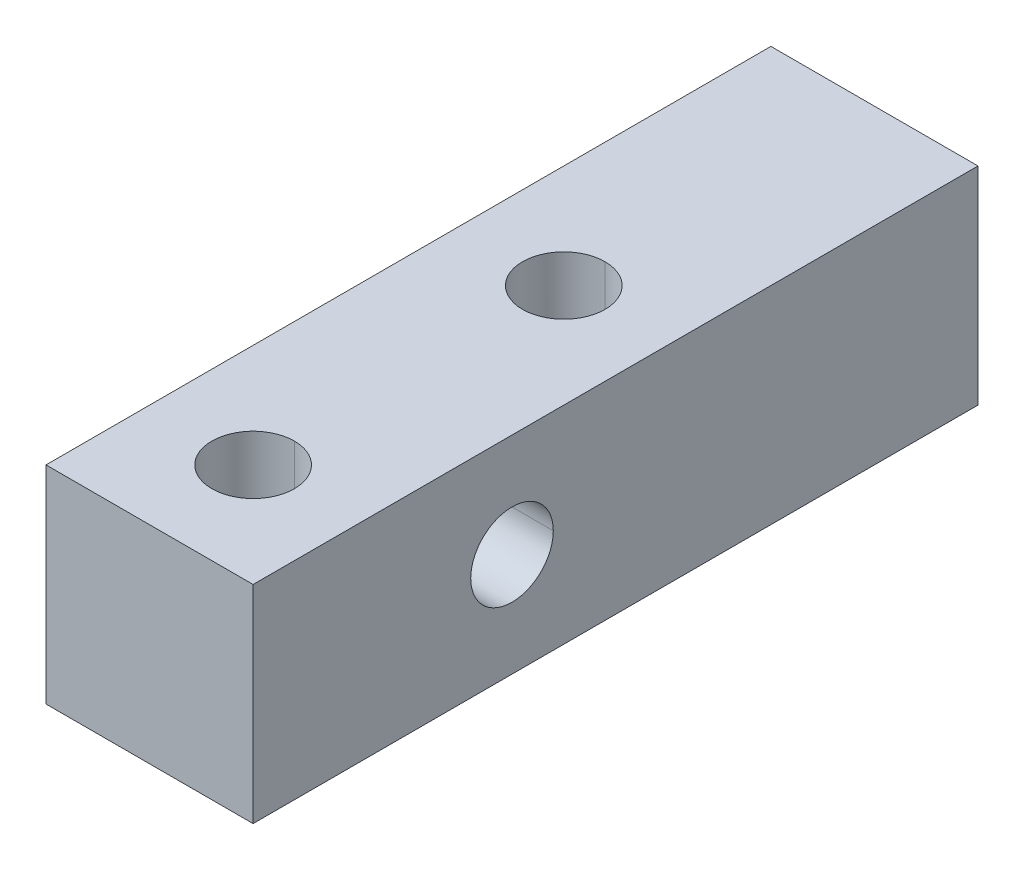
ISO-10303-21;
HEADER;
FILE_DESCRIPTION(('STEP AP214'),'2;1');
FILE_NAME('part.step','',(''),(''),'','','');
FILE_SCHEMA(('AUTOMOTIVE_DESIGN { 1 0 10303 214 1 1 1 1 }'));
ENDSEC;
DATA;
#1=APPLICATION_CONTEXT('core data for automotive mechanical design processes');
#2=APPLICATION_PROTOCOL_DEFINITION('international standard','automotive_design',2000,#1);
#3=PRODUCT_CONTEXT('',#1,'mechanical');
#4=PRODUCT('Part','Part','',(#3));
#5=PRODUCT_RELATED_PRODUCT_CATEGORY('part','',(#4));
#6=PRODUCT_DEFINITION_FORMATION('','',#4);
#7=PRODUCT_DEFINITION_CONTEXT('part definition',#1,'design');
#8=PRODUCT_DEFINITION('design','',#6,#7);
#9=PRODUCT_DEFINITION_SHAPE('','',#8);
#10=(LENGTH_UNIT() NAMED_UNIT(*) SI_UNIT(.MILLI.,.METRE.));
#11=(NAMED_UNIT(*) PLANE_ANGLE_UNIT() SI_UNIT($,.RADIAN.));
#12=(NAMED_UNIT(*) SI_UNIT($,.STERADIAN.) SOLID_ANGLE_UNIT());
#13=UNCERTAINTY_MEASURE_WITH_UNIT(LENGTH_MEASURE(1.E-05),#10,'distance_accuracy_value','');
#14=(GEOMETRIC_REPRESENTATION_CONTEXT(3) GLOBAL_UNCERTAINTY_ASSIGNED_CONTEXT((#13)) GLOBAL_UNIT_ASSIGNED_CONTEXT((#10,
#11,#12)) REPRESENTATION_CONTEXT('',''));
#15=CARTESIAN_POINT('',(0.,0.,0.));
#16=DIRECTION('',(0.,0.,1.));
#17=DIRECTION('',(1.,0.,0.));
#18=AXIS2_PLACEMENT_3D('',#15,#16,#17);
#19=CARTESIAN_POINT('',(0.,4.7625,-19.05));
#20=DIRECTION('',(0.,1.,0.));
#21=DIRECTION('',(0.,0.,1.));
#22=AXIS2_PLACEMENT_3D('',#19,#20,#21);
#23=CYLINDRICAL_SURFACE('',#22,1.89865);
#24=DIRECTION('',(0.,1.,0.));
#25=VECTOR('',#24,1.);
#26=CARTESIAN_POINT('',(0.,4.7625,-20.94865));
#27=LINE('',#26,#25);
#28=CARTESIAN_POINT('',(0.,-4.7625,-20.94865));
#29=VERTEX_POINT('',#28);
#30=CARTESIAN_POINT('',(0.,-1.89865,-20.94865));
#31=VERTEX_POINT('',#30);
#32=EDGE_CURVE('E227',#29,#31,#27,.T.);
#33=ORIENTED_EDGE('',*,*,#32,.F.);
#34=CARTESIAN_POINT('',(0.,-4.7625,-19.05));
#35=DIRECTION('',(0.,1.,0.));
#36=DIRECTION('',(0.,0.,1.));
#37=AXIS2_PLACEMENT_3D('',#34,#35,#36);
#38=CIRCLE('',#37,1.89865);
#39=CARTESIAN_POINT('',(0.,-4.7625,-17.15135));
#40=VERTEX_POINT('',#39);
#41=EDGE_CURVE('E200',#40,#29,#38,.T.);
#42=ORIENTED_EDGE('',*,*,#41,.F.);
#43=DIRECTION('',(0.,1.,0.));
#44=VECTOR('',#43,1.);
#45=CARTESIAN_POINT('',(0.,4.7625,-17.15135));
#46=LINE('',#45,#44);
#47=CARTESIAN_POINT('',(0.,4.7625,-17.15135));
#48=VERTEX_POINT('',#47);
#49=EDGE_CURVE('E216',#40,#48,#46,.T.);
#50=ORIENTED_EDGE('',*,*,#49,.T.);
#51=CARTESIAN_POINT('',(0.,4.7625,-19.05));
#52=DIRECTION('',(0.,1.,0.));
#53=DIRECTION('',(0.,0.,1.));
#54=AXIS2_PLACEMENT_3D('',#51,#52,#53);
#55=CIRCLE('',#54,1.89865);
#56=CARTESIAN_POINT('',(0.,4.7625,-20.94865));
#57=VERTEX_POINT('',#56);
#58=EDGE_CURVE('E171',#48,#57,#55,.T.);
#59=ORIENTED_EDGE('',*,*,#58,.T.);
#60=DIRECTION('',(0.,1.,0.));
#61=VECTOR('',#60,1.);
#62=CARTESIAN_POINT('',(0.,4.7625,-20.94865));
#63=LINE('',#62,#61);
#64=CARTESIAN_POINT('',(0.,1.89865,-20.94865));
#65=VERTEX_POINT('',#64);
#66=EDGE_CURVE('E203',#65,#57,#63,.T.);
#67=ORIENTED_EDGE('',*,*,#66,.F.);
#68=CARTESIAN_POINT('',(1.89865,0.,-19.05));
#69=CARTESIAN_POINT('',(1.89864999999999,1.11220341980032,-20.1622034198003));
#70=CARTESIAN_POINT('',(1.11220341980032,1.89864999999999,-20.94865));
#71=CARTESIAN_POINT('',(0.,1.89865,-20.94865));
#72=(BOUNDED_CURVE() B_SPLINE_CURVE(3,(#68,#69,#70,#71),.UNSPECIFIED.,.F.,
.F.) B_SPLINE_CURVE_WITH_KNOTS((4,4),(4.71238898038469,6.28318530717959),
.UNSPECIFIED.) CURVE() GEOMETRIC_REPRESENTATION_ITEM() RATIONAL_B_SPLINE_CURVE((1.,
0.804737854124365,0.804737854124365,1.)) REPRESENTATION_ITEM(''));
#73=CARTESIAN_POINT('',(1.89865,0.,-19.05));
#74=VERTEX_POINT('',#73);
#75=EDGE_CURVE('E11',#74,#65,#72,.T.);
#76=ORIENTED_EDGE('',*,*,#75,.F.);
#77=CARTESIAN_POINT('',(0.,-1.89865,-20.94865));
#78=CARTESIAN_POINT('',(1.11220341980032,-1.89864999999999,-20.94865));
#79=CARTESIAN_POINT('',(1.89864999999999,-1.11220341980032,-20.1622034198003));
#80=CARTESIAN_POINT('',(1.89865,0.,-19.05));
#81=(BOUNDED_CURVE() B_SPLINE_CURVE(3,(#77,#78,#79,#80),.UNSPECIFIED.,.F.,
.F.) B_SPLINE_CURVE_WITH_KNOTS((4,4),(0.,1.5707963267949),
.UNSPECIFIED.) CURVE() GEOMETRIC_REPRESENTATION_ITEM() RATIONAL_B_SPLINE_CURVE((1.,
0.804737854124365,0.804737854124365,1.)) REPRESENTATION_ITEM(''));
#82=EDGE_CURVE('E247',#31,#74,#81,.T.);
#83=ORIENTED_EDGE('',*,*,#82,.F.);
#84=EDGE_LOOP('',(#33,#42,#50,#59,#67,#76,#83));
#85=FACE_BOUND('',#84,.T.);
#86=ADVANCED_FACE('F16',(#85),#23,.F.);
#87=CARTESIAN_POINT('',(4.7625,0.,-11.90625));
#88=DIRECTION('',(1.,0.,0.));
#89=DIRECTION('',(0.,0.,-1.));
#90=AXIS2_PLACEMENT_3D('',#87,#88,#89);
#91=CYLINDRICAL_SURFACE('',#90,1.89865);
#92=DIRECTION('',(1.,0.,0.));
#93=VECTOR('',#92,1.);
#94=CARTESIAN_POINT('',(4.7625,0.,-10.0076));
#95=LINE('',#94,#93);
#96=CARTESIAN_POINT('',(-4.7625,0.,-10.0076));
#97=VERTEX_POINT('',#96);
#98=CARTESIAN_POINT('',(4.7625,0.,-10.0076));
#99=VERTEX_POINT('',#98);
#100=EDGE_CURVE('E261',#97,#99,#95,.T.);
#101=ORIENTED_EDGE('',*,*,#100,.F.);
#102=CARTESIAN_POINT('',(-4.7625,0.,-11.90625));
#103=DIRECTION('',(-1.,0.,0.));
#104=DIRECTION('',(0.,0.,1.));
#105=AXIS2_PLACEMENT_3D('',#102,#103,#104);
#106=CIRCLE('',#105,1.89865);
#107=CARTESIAN_POINT('',(-4.7625,0.,-13.8049));
#108=VERTEX_POINT('',#107);
#109=EDGE_CURVE('E181',#97,#108,#106,.T.);
#110=ORIENTED_EDGE('',*,*,#109,.T.);
#111=DIRECTION('',(1.,0.,0.));
#112=VECTOR('',#111,1.);
#113=CARTESIAN_POINT('',(4.7625,0.,-13.8049));
#114=LINE('',#113,#112);
#115=CARTESIAN_POINT('',(4.7625,0.,-13.8049));
#116=VERTEX_POINT('',#115);
#117=EDGE_CURVE('E254',#108,#116,#114,.T.);
#118=ORIENTED_EDGE('',*,*,#117,.T.);
#119=CARTESIAN_POINT('',(4.7625,0.,-11.90625));
#120=DIRECTION('',(1.,0.,0.));
#121=DIRECTION('',(0.,0.,-1.));
#122=AXIS2_PLACEMENT_3D('',#119,#120,#121);
#123=CIRCLE('',#122,1.89865);
#124=EDGE_CURVE('E161',#116,#99,#123,.T.);
#125=ORIENTED_EDGE('',*,*,#124,.T.);
#126=EDGE_LOOP('',(#101,#110,#118,#125));
#127=FACE_BOUND('',#126,.T.);
#128=ADVANCED_FACE('F358',(#127),#91,.F.);
#129=CARTESIAN_POINT('',(0.,0.,-33.3375));
#130=DIRECTION('',(0.,0.,-1.));
#131=DIRECTION('',(-1.,0.,0.));
#132=AXIS2_PLACEMENT_3D('',#129,#130,#131);
#133=CYLINDRICAL_SURFACE('',#132,1.89865);
#134=DIRECTION('',(0.,0.,-1.));
#135=VECTOR('',#134,1.);
#136=CARTESIAN_POINT('',(1.89865,0.,-33.3375));
#137=LINE('',#136,#135);
#138=CARTESIAN_POINT('',(1.89865,0.,-33.3375));
#139=VERTEX_POINT('',#138);
#140=EDGE_CURVE('E253',#74,#139,#137,.T.);
#141=ORIENTED_EDGE('',*,*,#140,.F.);
#142=ORIENTED_EDGE('',*,*,#75,.T.);
#143=CARTESIAN_POINT('',(0.,1.89865,-20.94865));
#144=CARTESIAN_POINT('',(-1.11220341980032,1.89864999999999,-20.94865));
#145=CARTESIAN_POINT('',(-1.89864999999999,1.11220341980032,-20.1622034198003));
#146=CARTESIAN_POINT('',(-1.89865,0.,-19.05));
#147=(BOUNDED_CURVE() B_SPLINE_CURVE(3,(#143,#144,#145,#146),.UNSPECIFIED.,.F.,
.F.) B_SPLINE_CURVE_WITH_KNOTS((4,4),(0.,1.5707963267949),
.UNSPECIFIED.) CURVE() GEOMETRIC_REPRESENTATION_ITEM() RATIONAL_B_SPLINE_CURVE((1.,
0.804737854124365,0.804737854124365,1.)) REPRESENTATION_ITEM(''));
#148=CARTESIAN_POINT('',(-1.89865,0.,-19.05));
#149=VERTEX_POINT('',#148);
#150=EDGE_CURVE('E207',#65,#149,#147,.T.);
#151=ORIENTED_EDGE('',*,*,#150,.T.);
#152=DIRECTION('',(0.,0.,-1.));
#153=VECTOR('',#152,1.);
#154=CARTESIAN_POINT('',(-1.89865,0.,-33.3375));
#155=LINE('',#154,#153);
#156=CARTESIAN_POINT('',(-1.89865,0.,-33.3375));
#157=VERTEX_POINT('',#156);
#158=EDGE_CURVE('E235',#149,#157,#155,.T.);
#159=ORIENTED_EDGE('',*,*,#158,.T.);
#160=CARTESIAN_POINT('',(0.,0.,-33.3375));
#161=DIRECTION('',(0.,0.,-1.));
#162=DIRECTION('',(-1.,0.,0.));
#163=AXIS2_PLACEMENT_3D('',#160,#161,#162);
#164=CIRCLE('',#163,1.89865);
#165=EDGE_CURVE('E27',#157,#139,#164,.T.);
#166=ORIENTED_EDGE('',*,*,#165,.T.);
#167=EDGE_LOOP('',(#141,#142,#151,#159,#166));
#168=FACE_BOUND('',#167,.T.);
#169=ADVANCED_FACE('F342',(#168),#133,.F.);
#170=CARTESIAN_POINT('',(0.,4.7625,-4.7625));
#171=DIRECTION('',(0.,1.,0.));
#172=DIRECTION('',(0.,0.,1.));
#173=AXIS2_PLACEMENT_3D('',#170,#171,#172);
#174=CYLINDRICAL_SURFACE('',#173,1.89865);
#175=DIRECTION('',(0.,1.,0.));
#176=VECTOR('',#175,1.);
#177=CARTESIAN_POINT('',(0.,4.7625,-6.66115));
#178=LINE('',#177,#176);
#179=CARTESIAN_POINT('',(0.,-4.7625,-6.66115));
#180=VERTEX_POINT('',#179);
#181=CARTESIAN_POINT('',(0.,4.7625,-6.66115));
#182=VERTEX_POINT('',#181);
#183=EDGE_CURVE('E269',#180,#182,#178,.T.);
#184=ORIENTED_EDGE('',*,*,#183,.F.);
#185=CARTESIAN_POINT('',(0.,-4.7625,-4.7625));
#186=DIRECTION('',(0.,1.,0.));
#187=DIRECTION('',(0.,0.,1.));
#188=AXIS2_PLACEMENT_3D('',#185,#186,#187);
#189=CIRCLE('',#188,1.89865);
#190=CARTESIAN_POINT('',(0.,-4.7625,-2.86385));
#191=VERTEX_POINT('',#190);
#192=EDGE_CURVE('E102',#191,#180,#189,.T.);
#193=ORIENTED_EDGE('',*,*,#192,.F.);
#194=DIRECTION('',(0.,1.,0.));
#195=VECTOR('',#194,1.);
#196=CARTESIAN_POINT('',(0.,4.7625,-2.86385));
#197=LINE('',#196,#195);
#198=CARTESIAN_POINT('',(0.,4.7625,-2.86385));
#199=VERTEX_POINT('',#198);
#200=EDGE_CURVE('E187',#191,#199,#197,.T.);
#201=ORIENTED_EDGE('',*,*,#200,.T.);
#202=CARTESIAN_POINT('',(0.,4.7625,-4.7625));
#203=DIRECTION('',(0.,1.,0.));
#204=DIRECTION('',(0.,0.,1.));
#205=AXIS2_PLACEMENT_3D('',#202,#203,#204);
#206=CIRCLE('',#205,1.89865);
#207=EDGE_CURVE('E90',#199,#182,#206,.T.);
#208=ORIENTED_EDGE('',*,*,#207,.T.);
#209=EDGE_LOOP('',(#184,#193,#201,#208));
#210=FACE_BOUND('',#209,.T.);
#211=ADVANCED_FACE('F353',(#210),#174,.F.);
#212=CARTESIAN_POINT('',(-4.7625,4.7625,0.));
#213=DIRECTION('',(0.,0.,1.));
#214=DIRECTION('',(1.,0.,0.));
#215=AXIS2_PLACEMENT_3D('',#212,#213,#214);
#216=PLANE('',#215);
#217=DIRECTION('',(0.,-1.,0.));
#218=VECTOR('',#217,1.);
#219=CARTESIAN_POINT('',(-4.7625,-4.7625,0.));
#220=LINE('',#219,#218);
#221=CARTESIAN_POINT('',(-4.7625,4.7625,0.));
#222=VERTEX_POINT('',#221);
#223=CARTESIAN_POINT('',(-4.7625,-4.7625,0.));
#224=VERTEX_POINT('',#223);
#225=EDGE_CURVE('E190',#222,#224,#220,.T.);
#226=ORIENTED_EDGE('',*,*,#225,.T.);
#227=DIRECTION('',(1.,0.,0.));
#228=VECTOR('',#227,1.);
#229=CARTESIAN_POINT('',(4.7625,-4.7625,0.));
#230=LINE('',#229,#228);
#231=CARTESIAN_POINT('',(4.7625,-4.7625,0.));
#232=VERTEX_POINT('',#231);
#233=EDGE_CURVE('E202',#224,#232,#230,.T.);
#234=ORIENTED_EDGE('',*,*,#233,.T.);
#235=DIRECTION('',(0.,1.,0.));
#236=VECTOR('',#235,1.);
#237=CARTESIAN_POINT('',(4.7625,-4.7625,0.));
#238=LINE('',#237,#236);
#239=CARTESIAN_POINT('',(4.7625,4.7625,0.));
#240=VERTEX_POINT('',#239);
#241=EDGE_CURVE('E197',#232,#240,#238,.T.);
#242=ORIENTED_EDGE('',*,*,#241,.T.);
#243=DIRECTION('',(-1.,0.,0.));
#244=VECTOR('',#243,1.);
#245=CARTESIAN_POINT('',(4.7625,4.7625,0.));
#246=LINE('',#245,#244);
#247=EDGE_CURVE('E174',#240,#222,#246,.T.);
#248=ORIENTED_EDGE('',*,*,#247,.T.);
#249=EDGE_LOOP('',(#226,#234,#242,#248));
#250=FACE_BOUND('',#249,.T.);
#251=ADVANCED_FACE('F306',(#250),#216,.T.);
#252=CARTESIAN_POINT('',(-4.7625,4.7625,-33.3375));
#253=DIRECTION('',(0.,0.,1.));
#254=DIRECTION('',(1.,0.,0.));
#255=AXIS2_PLACEMENT_3D('',#252,#253,#254);
#256=PLANE('',#255);
#257=ORIENTED_EDGE('',*,*,#165,.F.);
#258=CARTESIAN_POINT('',(0.,0.,-33.3375));
#259=DIRECTION('',(0.,0.,-1.));
#260=DIRECTION('',(-1.,0.,0.));
#261=AXIS2_PLACEMENT_3D('',#258,#259,#260);
#262=CIRCLE('',#261,1.89865);
#263=EDGE_CURVE('E242',#139,#157,#262,.T.);
#264=ORIENTED_EDGE('',*,*,#263,.F.);
#265=EDGE_LOOP('',(#257,#264));
#266=FACE_BOUND('',#265,.T.);
#267=DIRECTION('',(0.,-1.,0.));
#268=VECTOR('',#267,1.);
#269=CARTESIAN_POINT('',(-4.7625,-4.7625,-33.3375));
#270=LINE('',#269,#268);
#271=CARTESIAN_POINT('',(-4.7625,4.7625,-33.3375));
#272=VERTEX_POINT('',#271);
#273=CARTESIAN_POINT('',(-4.7625,-4.7625,-33.3375));
#274=VERTEX_POINT('',#273);
#275=EDGE_CURVE('E20',#272,#274,#270,.T.);
#276=ORIENTED_EDGE('',*,*,#275,.F.);
#277=DIRECTION('',(-1.,0.,0.));
#278=VECTOR('',#277,1.);
#279=CARTESIAN_POINT('',(4.7625,4.7625,-33.3375));
#280=LINE('',#279,#278);
#281=CARTESIAN_POINT('',(4.7625,4.7625,-33.3375));
#282=VERTEX_POINT('',#281);
#283=EDGE_CURVE('E164',#282,#272,#280,.T.);
#284=ORIENTED_EDGE('',*,*,#283,.F.);
#285=DIRECTION('',(0.,1.,0.));
#286=VECTOR('',#285,1.);
#287=CARTESIAN_POINT('',(4.7625,-4.7625,-33.3375));
#288=LINE('',#287,#286);
#289=CARTESIAN_POINT('',(4.7625,-4.7625,-33.3375));
#290=VERTEX_POINT('',#289);
#291=EDGE_CURVE('E151',#290,#282,#288,.T.);
#292=ORIENTED_EDGE('',*,*,#291,.F.);
#293=DIRECTION('',(1.,0.,0.));
#294=VECTOR('',#293,1.);
#295=CARTESIAN_POINT('',(4.7625,-4.7625,-33.3375));
#296=LINE('',#295,#294);
#297=EDGE_CURVE('E42',#274,#290,#296,.T.);
#298=ORIENTED_EDGE('',*,*,#297,.F.);
#299=EDGE_LOOP('',(#276,#284,#292,#298));
#300=FACE_BOUND('',#299,.T.);
#301=ADVANCED_FACE('F165',(#266,#300),#256,.F.);
#302=CARTESIAN_POINT('',(4.7625,-4.7625,-33.3375));
#303=DIRECTION('',(0.,-1.,0.));
#304=DIRECTION('',(0.,0.,-1.));
#305=AXIS2_PLACEMENT_3D('',#302,#303,#304);
#306=PLANE('',#305);
#307=ORIENTED_EDGE('',*,*,#192,.T.);
#308=CARTESIAN_POINT('',(0.,-4.7625,-4.7625));
#309=DIRECTION('',(0.,1.,0.));
#310=DIRECTION('',(0.,0.,1.));
#311=AXIS2_PLACEMENT_3D('',#308,#309,#310);
#312=CIRCLE('',#311,1.89865);
#313=EDGE_CURVE('E241',#180,#191,#312,.T.);
#314=ORIENTED_EDGE('',*,*,#313,.T.);
#315=EDGE_LOOP('',(#307,#314));
#316=FACE_BOUND('',#315,.T.);
#317=ORIENTED_EDGE('',*,*,#41,.T.);
#318=CARTESIAN_POINT('',(0.,-4.7625,-19.05));
#319=DIRECTION('',(0.,1.,0.));
#320=DIRECTION('',(0.,0.,1.));
#321=AXIS2_PLACEMENT_3D('',#318,#319,#320);
#322=CIRCLE('',#321,1.89865);
#323=EDGE_CURVE('E319',#29,#40,#322,.T.);
#324=ORIENTED_EDGE('',*,*,#323,.T.);
#325=EDGE_LOOP('',(#317,#324));
#326=FACE_BOUND('',#325,.T.);
#327=ORIENTED_EDGE('',*,*,#233,.F.);
#328=DIRECTION('',(0.,0.,1.));
#329=VECTOR('',#328,1.);
#330=CARTESIAN_POINT('',(-4.7625,-4.7625,-33.3375));
#331=LINE('',#330,#329);
#332=EDGE_CURVE('E191',#274,#224,#331,.T.);
#333=ORIENTED_EDGE('',*,*,#332,.F.);
#334=ORIENTED_EDGE('',*,*,#297,.T.);
#335=DIRECTION('',(0.,0.,1.));
#336=VECTOR('',#335,1.);
#337=CARTESIAN_POINT('',(4.7625,-4.7625,-33.3375));
#338=LINE('',#337,#336);
#339=EDGE_CURVE('E158',#290,#232,#338,.T.);
#340=ORIENTED_EDGE('',*,*,#339,.T.);
#341=EDGE_LOOP('',(#327,#333,#334,#340));
#342=FACE_BOUND('',#341,.T.);
#343=ADVANCED_FACE('F304',(#316,#326,#342),#306,.T.);
#344=CARTESIAN_POINT('',(4.7625,-4.7625,-33.3375));
#345=DIRECTION('',(1.,0.,0.));
#346=DIRECTION('',(0.,1.,0.));
#347=AXIS2_PLACEMENT_3D('',#344,#345,#346);
#348=PLANE('',#347);
#349=ORIENTED_EDGE('',*,*,#124,.F.);
#350=CARTESIAN_POINT('',(4.7625,0.,-11.90625));
#351=DIRECTION('',(1.,0.,0.));
#352=DIRECTION('',(0.,0.,-1.));
#353=AXIS2_PLACEMENT_3D('',#350,#351,#352);
#354=CIRCLE('',#353,1.89865);
#355=EDGE_CURVE('E273',#99,#116,#354,.T.);
#356=ORIENTED_EDGE('',*,*,#355,.F.);
#357=EDGE_LOOP('',(#349,#356));
#358=FACE_BOUND('',#357,.T.);
#359=ORIENTED_EDGE('',*,*,#241,.F.);
#360=ORIENTED_EDGE('',*,*,#339,.F.);
#361=ORIENTED_EDGE('',*,*,#291,.T.);
#362=DIRECTION('',(0.,0.,1.));
#363=VECTOR('',#362,1.);
#364=CARTESIAN_POINT('',(4.7625,4.7625,-33.3375));
#365=LINE('',#364,#363);
#366=EDGE_CURVE('E156',#282,#240,#365,.T.);
#367=ORIENTED_EDGE('',*,*,#366,.T.);
#368=EDGE_LOOP('',(#359,#360,#361,#367));
#369=FACE_BOUND('',#368,.T.);
#370=ADVANCED_FACE('F154',(#358,#369),#348,.T.);
#371=CARTESIAN_POINT('',(4.7625,4.7625,-33.3375));
#372=DIRECTION('',(0.,1.,0.));
#373=DIRECTION('',(1.,0.,0.));
#374=AXIS2_PLACEMENT_3D('',#371,#372,#373);
#375=PLANE('',#374);
#376=ORIENTED_EDGE('',*,*,#207,.F.);
#377=CARTESIAN_POINT('',(0.,4.7625,-4.7625));
#378=DIRECTION('',(0.,1.,0.));
#379=DIRECTION('',(0.,0.,1.));
#380=AXIS2_PLACEMENT_3D('',#377,#378,#379);
#381=CIRCLE('',#380,1.89865);
#382=EDGE_CURVE('E185',#182,#199,#381,.T.);
#383=ORIENTED_EDGE('',*,*,#382,.F.);
#384=EDGE_LOOP('',(#376,#383));
#385=FACE_BOUND('',#384,.T.);
#386=ORIENTED_EDGE('',*,*,#58,.F.);
#387=CARTESIAN_POINT('',(0.,4.7625,-19.05));
#388=DIRECTION('',(0.,1.,0.));
#389=DIRECTION('',(0.,0.,1.));
#390=AXIS2_PLACEMENT_3D('',#387,#388,#389);
#391=CIRCLE('',#390,1.89865);
#392=EDGE_CURVE('E206',#57,#48,#391,.T.);
#393=ORIENTED_EDGE('',*,*,#392,.F.);
#394=EDGE_LOOP('',(#386,#393));
#395=FACE_BOUND('',#394,.T.);
#396=ORIENTED_EDGE('',*,*,#247,.F.);
#397=ORIENTED_EDGE('',*,*,#366,.F.);
#398=ORIENTED_EDGE('',*,*,#283,.T.);
#399=DIRECTION('',(0.,0.,1.));
#400=VECTOR('',#399,1.);
#401=CARTESIAN_POINT('',(-4.7625,4.7625,-33.3375));
#402=LINE('',#401,#400);
#403=EDGE_CURVE('E268',#272,#222,#402,.T.);
#404=ORIENTED_EDGE('',*,*,#403,.T.);
#405=EDGE_LOOP('',(#396,#397,#398,#404));
#406=FACE_BOUND('',#405,.T.);
#407=ADVANCED_FACE('F173',(#385,#395,#406),#375,.T.);
#408=CARTESIAN_POINT('',(-4.7625,-4.7625,-33.3375));
#409=DIRECTION('',(-1.,0.,0.));
#410=DIRECTION('',(0.,0.,1.));
#411=AXIS2_PLACEMENT_3D('',#408,#409,#410);
#412=PLANE('',#411);
#413=CARTESIAN_POINT('',(-4.7625,0.,-11.90625));
#414=DIRECTION('',(-1.,0.,0.));
#415=DIRECTION('',(0.,0.,1.));
#416=AXIS2_PLACEMENT_3D('',#413,#414,#415);
#417=CIRCLE('',#416,1.89865);
#418=EDGE_CURVE('E246',#108,#97,#417,.T.);
#419=ORIENTED_EDGE('',*,*,#418,.F.);
#420=ORIENTED_EDGE('',*,*,#109,.F.);
#421=EDGE_LOOP('',(#419,#420));
#422=FACE_BOUND('',#421,.T.);
#423=ORIENTED_EDGE('',*,*,#225,.F.);
#424=ORIENTED_EDGE('',*,*,#403,.F.);
#425=ORIENTED_EDGE('',*,*,#275,.T.);
#426=ORIENTED_EDGE('',*,*,#332,.T.);
#427=EDGE_LOOP('',(#423,#424,#425,#426));
#428=FACE_BOUND('',#427,.T.);
#429=ADVANCED_FACE('F377',(#422,#428),#412,.T.);
#430=CARTESIAN_POINT('',(0.,4.7625,-4.7625));
#431=DIRECTION('',(0.,1.,0.));
#432=DIRECTION('',(0.,0.,1.));
#433=AXIS2_PLACEMENT_3D('',#430,#431,#432);
#434=CYLINDRICAL_SURFACE('',#433,1.89865);
#435=ORIENTED_EDGE('',*,*,#313,.F.);
#436=ORIENTED_EDGE('',*,*,#183,.T.);
#437=ORIENTED_EDGE('',*,*,#382,.T.);
#438=ORIENTED_EDGE('',*,*,#200,.F.);
#439=EDGE_LOOP('',(#435,#436,#437,#438));
#440=FACE_BOUND('',#439,.T.);
#441=ADVANCED_FACE('F375',(#440),#434,.F.);
#442=CARTESIAN_POINT('',(0.,0.,-33.3375));
#443=DIRECTION('',(0.,0.,-1.));
#444=DIRECTION('',(-1.,0.,0.));
#445=AXIS2_PLACEMENT_3D('',#442,#443,#444);
#446=CYLINDRICAL_SURFACE('',#445,1.89865);
#447=CARTESIAN_POINT('',(-1.89865,0.,-19.05));
#448=CARTESIAN_POINT('',(-1.89864999999999,-1.11220341980032,-20.1622034198003));
#449=CARTESIAN_POINT('',(-1.11220341980032,-1.89864999999999,-20.94865));
#450=CARTESIAN_POINT('',(0.,-1.89865,-20.94865));
#451=(BOUNDED_CURVE() B_SPLINE_CURVE(3,(#447,#448,#449,#450),.UNSPECIFIED.,.F.,
.F.) B_SPLINE_CURVE_WITH_KNOTS((4,4),(4.71238898038469,6.28318530717959),
.UNSPECIFIED.) CURVE() GEOMETRIC_REPRESENTATION_ITEM() RATIONAL_B_SPLINE_CURVE((1.,
0.804737854124365,0.804737854124365,1.)) REPRESENTATION_ITEM(''));
#452=EDGE_CURVE('E218',#149,#31,#451,.T.);
#453=ORIENTED_EDGE('',*,*,#452,.T.);
#454=ORIENTED_EDGE('',*,*,#82,.T.);
#455=ORIENTED_EDGE('',*,*,#140,.T.);
#456=ORIENTED_EDGE('',*,*,#263,.T.);
#457=ORIENTED_EDGE('',*,*,#158,.F.);
#458=EDGE_LOOP('',(#453,#454,#455,#456,#457));
#459=FACE_BOUND('',#458,.T.);
#460=ADVANCED_FACE('F339',(#459),#446,.F.);
#461=CARTESIAN_POINT('',(4.7625,0.,-11.90625));
#462=DIRECTION('',(1.,0.,0.));
#463=DIRECTION('',(0.,0.,-1.));
#464=AXIS2_PLACEMENT_3D('',#461,#462,#463);
#465=CYLINDRICAL_SURFACE('',#464,1.89865);
#466=ORIENTED_EDGE('',*,*,#418,.T.);
#467=ORIENTED_EDGE('',*,*,#100,.T.);
#468=ORIENTED_EDGE('',*,*,#355,.T.);
#469=ORIENTED_EDGE('',*,*,#117,.F.);
#470=EDGE_LOOP('',(#466,#467,#468,#469));
#471=FACE_BOUND('',#470,.T.);
#472=ADVANCED_FACE('F18',(#471),#465,.F.);
#473=CARTESIAN_POINT('',(0.,4.7625,-19.05));
#474=DIRECTION('',(0.,1.,0.));
#475=DIRECTION('',(0.,0.,1.));
#476=AXIS2_PLACEMENT_3D('',#473,#474,#475);
#477=CYLINDRICAL_SURFACE('',#476,1.89865);
#478=ORIENTED_EDGE('',*,*,#323,.F.);
#479=ORIENTED_EDGE('',*,*,#32,.T.);
#480=ORIENTED_EDGE('',*,*,#452,.F.);
#481=ORIENTED_EDGE('',*,*,#150,.F.);
#482=ORIENTED_EDGE('',*,*,#66,.T.);
#483=ORIENTED_EDGE('',*,*,#392,.T.);
#484=ORIENTED_EDGE('',*,*,#49,.F.);
#485=EDGE_LOOP('',(#478,#479,#480,#481,#482,#483,#484));
#486=FACE_BOUND('',#485,.T.);
#487=ADVANCED_FACE('F372',(#486),#477,.F.);
#488=CLOSED_SHELL('',(#86,#128,#169,#211,#251,#301,#343,#370,#407,#429,#441,#460,#472,#487));
#489=MANIFOLD_SOLID_BREP('B1',#488);
#490=ADVANCED_BREP_SHAPE_REPRESENTATION('',(#18,#489),#14);
#491=SHAPE_DEFINITION_REPRESENTATION(#9,#490);
ENDSEC;
END-ISO-10303-21;
